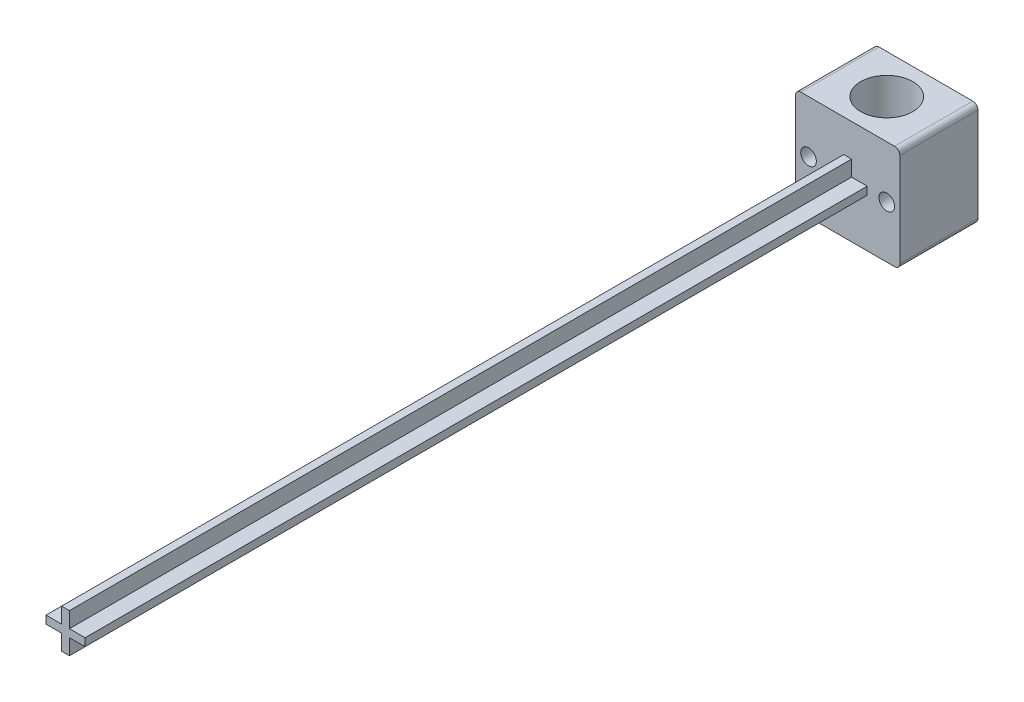
ISO-10303-21;
HEADER;
FILE_DESCRIPTION(('STEP AP214'),'2;1');
FILE_NAME('part.step','',(''),(''),'','','');
FILE_SCHEMA(('AUTOMOTIVE_DESIGN { 1 0 10303 214 1 1 1 1 }'));
ENDSEC;
DATA;
#1=APPLICATION_CONTEXT('core data for automotive mechanical design processes');
#2=APPLICATION_PROTOCOL_DEFINITION('international standard','automotive_design',2000,#1);
#3=PRODUCT_CONTEXT('',#1,'mechanical');
#4=PRODUCT('Part','Part','',(#3));
#5=PRODUCT_RELATED_PRODUCT_CATEGORY('part','',(#4));
#6=PRODUCT_DEFINITION_FORMATION('','',#4);
#7=PRODUCT_DEFINITION_CONTEXT('part definition',#1,'design');
#8=PRODUCT_DEFINITION('design','',#6,#7);
#9=PRODUCT_DEFINITION_SHAPE('','',#8);
#10=(LENGTH_UNIT() NAMED_UNIT(*) SI_UNIT(.MILLI.,.METRE.));
#11=(NAMED_UNIT(*) PLANE_ANGLE_UNIT() SI_UNIT($,.RADIAN.));
#12=(NAMED_UNIT(*) SI_UNIT($,.STERADIAN.) SOLID_ANGLE_UNIT());
#13=UNCERTAINTY_MEASURE_WITH_UNIT(LENGTH_MEASURE(1.E-05),#10,'distance_accuracy_value','');
#14=(GEOMETRIC_REPRESENTATION_CONTEXT(3) GLOBAL_UNCERTAINTY_ASSIGNED_CONTEXT((#13)) GLOBAL_UNIT_ASSIGNED_CONTEXT((#10,
#11,#12)) REPRESENTATION_CONTEXT('',''));
#15=CARTESIAN_POINT('',(0.,0.,0.));
#16=DIRECTION('',(0.,0.,1.));
#17=DIRECTION('',(1.,0.,0.));
#18=AXIS2_PLACEMENT_3D('',#15,#16,#17);
#19=CARTESIAN_POINT('',(0.,20.,0.));
#20=DIRECTION('',(0.,1.,0.));
#21=DIRECTION('',(0.,0.,1.));
#22=AXIS2_PLACEMENT_3D('',#19,#20,#21);
#23=PLANE('',#22);
#24=DIRECTION('',(1.,0.,0.));
#25=VECTOR('',#24,1.);
#26=CARTESIAN_POINT('',(-10.,20.,7.5));
#27=LINE('',#26,#25);
#28=CARTESIAN_POINT('',(-9.,20.,7.5));
#29=VERTEX_POINT('',#28);
#30=CARTESIAN_POINT('',(9.,20.,7.5));
#31=VERTEX_POINT('',#30);
#32=EDGE_CURVE('E329',#29,#31,#27,.T.);
#33=ORIENTED_EDGE('',*,*,#32,.T.);
#34=DIRECTION('',(0.,0.,-1.));
#35=VECTOR('',#34,1.);
#36=CARTESIAN_POINT('',(9.,20.,-7.5));
#37=LINE('',#36,#35);
#38=CARTESIAN_POINT('',(9.,20.,-7.5));
#39=VERTEX_POINT('',#38);
#40=EDGE_CURVE('E12',#31,#39,#37,.T.);
#41=ORIENTED_EDGE('',*,*,#40,.T.);
#42=DIRECTION('',(-1.,0.,0.));
#43=VECTOR('',#42,1.);
#44=CARTESIAN_POINT('',(-10.,20.,-7.5));
#45=LINE('',#44,#43);
#46=CARTESIAN_POINT('',(-9.,20.,-7.5));
#47=VERTEX_POINT('',#46);
#48=EDGE_CURVE('E325',#39,#47,#45,.T.);
#49=ORIENTED_EDGE('',*,*,#48,.T.);
#50=DIRECTION('',(0.,0.,1.));
#51=VECTOR('',#50,1.);
#52=CARTESIAN_POINT('',(-9.,20.,7.5));
#53=LINE('',#52,#51);
#54=EDGE_CURVE('E72',#47,#29,#53,.T.);
#55=ORIENTED_EDGE('',*,*,#54,.T.);
#56=EDGE_LOOP('',(#33,#41,#49,#55));
#57=FACE_BOUND('',#56,.T.);
#58=CARTESIAN_POINT('',(0.,20.,0.));
#59=DIRECTION('',(0.,1.,0.));
#60=DIRECTION('',(0.,0.,1.));
#61=AXIS2_PLACEMENT_3D('',#58,#59,#60);
#62=CIRCLE('',#61,5.);
#63=CARTESIAN_POINT('',(0.,20.,5.));
#64=VERTEX_POINT('',#63);
#65=EDGE_CURVE('E317',#64,#64,#62,.T.);
#66=ORIENTED_EDGE('',*,*,#65,.F.);
#67=EDGE_LOOP('',(#66));
#68=FACE_BOUND('',#67,.T.);
#69=ADVANCED_FACE('F63',(#57,#68),#23,.T.);
#70=CARTESIAN_POINT('',(0.,0.,0.));
#71=DIRECTION('',(0.,1.,0.));
#72=DIRECTION('',(0.,0.,1.));
#73=AXIS2_PLACEMENT_3D('',#70,#71,#72);
#74=PLANE('',#73);
#75=DIRECTION('',(1.,0.,0.));
#76=VECTOR('',#75,1.);
#77=CARTESIAN_POINT('',(-10.,0.,7.5));
#78=LINE('',#77,#76);
#79=CARTESIAN_POINT('',(-9.,0.,7.5));
#80=VERTEX_POINT('',#79);
#81=CARTESIAN_POINT('',(9.,0.,7.5));
#82=VERTEX_POINT('',#81);
#83=EDGE_CURVE('E330',#80,#82,#78,.T.);
#84=ORIENTED_EDGE('',*,*,#83,.F.);
#85=DIRECTION('',(0.,0.,1.));
#86=VECTOR('',#85,1.);
#87=CARTESIAN_POINT('',(-9.,0.,0.));
#88=LINE('',#87,#86);
#89=CARTESIAN_POINT('',(-9.,0.,-7.5));
#90=VERTEX_POINT('',#89);
#91=EDGE_CURVE('E377',#80,#90,#88,.F.);
#92=ORIENTED_EDGE('',*,*,#91,.T.);
#93=DIRECTION('',(-1.,0.,0.));
#94=VECTOR('',#93,1.);
#95=CARTESIAN_POINT('',(-10.,0.,-7.5));
#96=LINE('',#95,#94);
#97=CARTESIAN_POINT('',(9.,0.,-7.5));
#98=VERTEX_POINT('',#97);
#99=EDGE_CURVE('E321',#98,#90,#96,.T.);
#100=ORIENTED_EDGE('',*,*,#99,.F.);
#101=DIRECTION('',(0.,0.,-1.));
#102=VECTOR('',#101,1.);
#103=CARTESIAN_POINT('',(9.,0.,0.));
#104=LINE('',#103,#102);
#105=EDGE_CURVE('E374',#98,#82,#104,.F.);
#106=ORIENTED_EDGE('',*,*,#105,.T.);
#107=EDGE_LOOP('',(#84,#92,#100,#106));
#108=FACE_BOUND('',#107,.T.);
#109=CARTESIAN_POINT('',(0.,0.,0.));
#110=DIRECTION('',(0.,1.,0.));
#111=DIRECTION('',(0.,0.,1.));
#112=AXIS2_PLACEMENT_3D('',#109,#110,#111);
#113=CIRCLE('',#112,5.);
#114=CARTESIAN_POINT('',(0.,0.,5.));
#115=VERTEX_POINT('',#114);
#116=EDGE_CURVE('E316',#115,#115,#113,.T.);
#117=ORIENTED_EDGE('',*,*,#116,.T.);
#118=EDGE_LOOP('',(#117));
#119=FACE_BOUND('',#118,.T.);
#120=ADVANCED_FACE('F423',(#108,#119),#74,.F.);
#121=CARTESIAN_POINT('',(10.,20.,-7.5));
#122=DIRECTION('',(-1.,0.,0.));
#123=DIRECTION('',(0.,0.,1.));
#124=AXIS2_PLACEMENT_3D('',#121,#122,#123);
#125=PLANE('',#124);
#126=DIRECTION('',(0.,-1.,0.));
#127=VECTOR('',#126,1.);
#128=CARTESIAN_POINT('',(10.,20.,7.5));
#129=LINE('',#128,#127);
#130=CARTESIAN_POINT('',(10.,19.,7.5));
#131=VERTEX_POINT('',#130);
#132=CARTESIAN_POINT('',(10.,1.,7.5));
#133=VERTEX_POINT('',#132);
#134=EDGE_CURVE('E334',#131,#133,#129,.T.);
#135=ORIENTED_EDGE('',*,*,#134,.T.);
#136=DIRECTION('',(0.,0.,-1.));
#137=VECTOR('',#136,1.);
#138=CARTESIAN_POINT('',(10.,1.,-7.5));
#139=LINE('',#138,#137);
#140=CARTESIAN_POINT('',(10.,1.,-7.5));
#141=VERTEX_POINT('',#140);
#142=EDGE_CURVE('E393',#133,#141,#139,.T.);
#143=ORIENTED_EDGE('',*,*,#142,.T.);
#144=DIRECTION('',(0.,-1.,0.));
#145=VECTOR('',#144,1.);
#146=CARTESIAN_POINT('',(10.,20.,-7.5));
#147=LINE('',#146,#145);
#148=CARTESIAN_POINT('',(10.,19.,-7.5));
#149=VERTEX_POINT('',#148);
#150=EDGE_CURVE('E352',#149,#141,#147,.T.);
#151=ORIENTED_EDGE('',*,*,#150,.F.);
#152=DIRECTION('',(0.,0.,-1.));
#153=VECTOR('',#152,1.);
#154=CARTESIAN_POINT('',(10.,19.,7.5));
#155=LINE('',#154,#153);
#156=EDGE_CURVE('E390',#149,#131,#155,.F.);
#157=ORIENTED_EDGE('',*,*,#156,.T.);
#158=EDGE_LOOP('',(#135,#143,#151,#157));
#159=FACE_BOUND('',#158,.T.);
#160=ADVANCED_FACE('F430',(#159),#125,.F.);
#161=CARTESIAN_POINT('',(-10.,20.,-7.5));
#162=DIRECTION('',(0.,0.,1.));
#163=DIRECTION('',(1.,0.,0.));
#164=AXIS2_PLACEMENT_3D('',#161,#162,#163);
#165=PLANE('',#164);
#166=CARTESIAN_POINT('',(7.5,10.,-7.5));
#167=DIRECTION('',(0.,0.,1.));
#168=DIRECTION('',(1.,0.,0.));
#169=AXIS2_PLACEMENT_3D('',#166,#167,#168);
#170=CIRCLE('',#169,1.5);
#171=CARTESIAN_POINT('',(9.,10.,-7.5));
#172=VERTEX_POINT('',#171);
#173=EDGE_CURVE('E312',#172,#172,#170,.T.);
#174=ORIENTED_EDGE('',*,*,#173,.T.);
#175=EDGE_LOOP('',(#174));
#176=FACE_BOUND('',#175,.T.);
#177=CARTESIAN_POINT('',(-7.5,10.,-7.5));
#178=DIRECTION('',(0.,0.,1.));
#179=DIRECTION('',(1.,0.,0.));
#180=AXIS2_PLACEMENT_3D('',#177,#178,#179);
#181=CIRCLE('',#180,1.5);
#182=CARTESIAN_POINT('',(-6.,10.,-7.5));
#183=VERTEX_POINT('',#182);
#184=EDGE_CURVE('E305',#183,#183,#181,.T.);
#185=ORIENTED_EDGE('',*,*,#184,.T.);
#186=EDGE_LOOP('',(#185));
#187=FACE_BOUND('',#186,.T.);
#188=ORIENTED_EDGE('',*,*,#99,.T.);
#189=CARTESIAN_POINT('',(-9.,1.,-7.5));
#190=DIRECTION('',(0.,0.,1.));
#191=DIRECTION('',(1.,0.,0.));
#192=AXIS2_PLACEMENT_3D('',#189,#190,#191);
#193=CIRCLE('',#192,1.);
#194=CARTESIAN_POINT('',(-10.,1.,-7.5));
#195=VERTEX_POINT('',#194);
#196=EDGE_CURVE('E387',#90,#195,#193,.F.);
#197=ORIENTED_EDGE('',*,*,#196,.T.);
#198=DIRECTION('',(0.,-1.,0.));
#199=VECTOR('',#198,1.);
#200=CARTESIAN_POINT('',(-10.,20.,-7.5));
#201=LINE('',#200,#199);
#202=CARTESIAN_POINT('',(-10.,19.,-7.5));
#203=VERTEX_POINT('',#202);
#204=EDGE_CURVE('E348',#203,#195,#201,.T.);
#205=ORIENTED_EDGE('',*,*,#204,.F.);
#206=CARTESIAN_POINT('',(-9.,19.,-7.5));
#207=DIRECTION('',(0.,0.,1.));
#208=DIRECTION('',(1.,0.,0.));
#209=AXIS2_PLACEMENT_3D('',#206,#207,#208);
#210=CIRCLE('',#209,1.);
#211=EDGE_CURVE('E380',#203,#47,#210,.F.);
#212=ORIENTED_EDGE('',*,*,#211,.T.);
#213=ORIENTED_EDGE('',*,*,#48,.F.);
#214=CARTESIAN_POINT('',(9.,19.,-7.5));
#215=DIRECTION('',(0.,0.,1.));
#216=DIRECTION('',(1.,0.,0.));
#217=AXIS2_PLACEMENT_3D('',#214,#215,#216);
#218=CIRCLE('',#217,1.);
#219=EDGE_CURVE('E87',#39,#149,#218,.F.);
#220=ORIENTED_EDGE('',*,*,#219,.T.);
#221=ORIENTED_EDGE('',*,*,#150,.T.);
#222=CARTESIAN_POINT('',(9.,1.,-7.5));
#223=DIRECTION('',(0.,0.,1.));
#224=DIRECTION('',(1.,0.,0.));
#225=AXIS2_PLACEMENT_3D('',#222,#223,#224);
#226=CIRCLE('',#225,1.);
#227=EDGE_CURVE('E79',#141,#98,#226,.F.);
#228=ORIENTED_EDGE('',*,*,#227,.T.);
#229=EDGE_LOOP('',(#188,#197,#205,#212,#213,#220,#221,#228));
#230=FACE_BOUND('',#229,.T.);
#231=ADVANCED_FACE('F412',(#176,#187,#230),#165,.F.);
#232=CARTESIAN_POINT('',(-10.,20.,-7.5));
#233=DIRECTION('',(1.,0.,0.));
#234=DIRECTION('',(0.,0.,-1.));
#235=AXIS2_PLACEMENT_3D('',#232,#233,#234);
#236=PLANE('',#235);
#237=ORIENTED_EDGE('',*,*,#204,.T.);
#238=DIRECTION('',(0.,0.,1.));
#239=VECTOR('',#238,1.);
#240=CARTESIAN_POINT('',(-10.,1.,-7.5));
#241=LINE('',#240,#239);
#242=CARTESIAN_POINT('',(-10.,1.,7.5));
#243=VERTEX_POINT('',#242);
#244=EDGE_CURVE('E358',#195,#243,#241,.T.);
#245=ORIENTED_EDGE('',*,*,#244,.T.);
#246=DIRECTION('',(0.,-1.,0.));
#247=VECTOR('',#246,1.);
#248=CARTESIAN_POINT('',(-10.,20.,7.5));
#249=LINE('',#248,#247);
#250=CARTESIAN_POINT('',(-10.,19.,7.5));
#251=VERTEX_POINT('',#250);
#252=EDGE_CURVE('E344',#251,#243,#249,.T.);
#253=ORIENTED_EDGE('',*,*,#252,.F.);
#254=DIRECTION('',(0.,0.,1.));
#255=VECTOR('',#254,1.);
#256=CARTESIAN_POINT('',(-10.,19.,-7.5));
#257=LINE('',#256,#255);
#258=EDGE_CURVE('E355',#251,#203,#257,.F.);
#259=ORIENTED_EDGE('',*,*,#258,.T.);
#260=EDGE_LOOP('',(#237,#245,#253,#259));
#261=FACE_BOUND('',#260,.T.);
#262=ADVANCED_FACE('F416',(#261),#236,.F.);
#263=CARTESIAN_POINT('',(-10.,20.,7.5));
#264=DIRECTION('',(0.,0.,-1.));
#265=DIRECTION('',(-1.,0.,0.));
#266=AXIS2_PLACEMENT_3D('',#263,#264,#265);
#267=PLANE('',#266);
#268=DIRECTION('',(1.,0.,0.));
#269=VECTOR('',#268,1.);
#270=CARTESIAN_POINT('',(-0.749999999999999,13.75,7.5));
#271=LINE('',#270,#269);
#272=CARTESIAN_POINT('',(-0.749999999999999,13.75,7.5));
#273=VERTEX_POINT('',#272);
#274=CARTESIAN_POINT('',(0.750000000000001,13.75,7.5));
#275=VERTEX_POINT('',#274);
#276=EDGE_CURVE('E264',#273,#275,#271,.T.);
#277=ORIENTED_EDGE('',*,*,#276,.T.);
#278=DIRECTION('',(0.,-1.,0.));
#279=VECTOR('',#278,1.);
#280=CARTESIAN_POINT('',(0.750000000000001,13.75,7.5));
#281=LINE('',#280,#279);
#282=CARTESIAN_POINT('',(0.750000000000002,10.75,7.5));
#283=VERTEX_POINT('',#282);
#284=EDGE_CURVE('E269',#275,#283,#281,.T.);
#285=ORIENTED_EDGE('',*,*,#284,.T.);
#286=DIRECTION('',(1.,0.,0.));
#287=VECTOR('',#286,1.);
#288=CARTESIAN_POINT('',(-3.75,10.75,7.5));
#289=LINE('',#288,#287);
#290=CARTESIAN_POINT('',(3.75,10.75,7.5));
#291=VERTEX_POINT('',#290);
#292=EDGE_CURVE('E693',#283,#291,#289,.T.);
#293=ORIENTED_EDGE('',*,*,#292,.T.);
#294=DIRECTION('',(0.,-1.,0.));
#295=VECTOR('',#294,1.);
#296=CARTESIAN_POINT('',(3.75,10.75,7.5));
#297=LINE('',#296,#295);
#298=CARTESIAN_POINT('',(3.75,9.25,7.5));
#299=VERTEX_POINT('',#298);
#300=EDGE_CURVE('E689',#291,#299,#297,.T.);
#301=ORIENTED_EDGE('',*,*,#300,.T.);
#302=DIRECTION('',(1.,0.,0.));
#303=VECTOR('',#302,1.);
#304=CARTESIAN_POINT('',(-3.75,9.25,7.5));
#305=LINE('',#304,#303);
#306=CARTESIAN_POINT('',(0.750000000000001,9.25,7.5));
#307=VERTEX_POINT('',#306);
#308=EDGE_CURVE('E685',#307,#299,#305,.T.);
#309=ORIENTED_EDGE('',*,*,#308,.F.);
#310=CARTESIAN_POINT('',(0.750000000000002,6.25,7.5));
#311=VERTEX_POINT('',#310);
#312=EDGE_CURVE('E268',#307,#311,#281,.T.);
#313=ORIENTED_EDGE('',*,*,#312,.T.);
#314=DIRECTION('',(1.,0.,0.));
#315=VECTOR('',#314,1.);
#316=CARTESIAN_POINT('',(-0.749999999999998,6.25,7.5));
#317=LINE('',#316,#315);
#318=CARTESIAN_POINT('',(-0.749999999999998,6.25,7.5));
#319=VERTEX_POINT('',#318);
#320=EDGE_CURVE('E273',#319,#311,#317,.T.);
#321=ORIENTED_EDGE('',*,*,#320,.F.);
#322=DIRECTION('',(0.,-1.,0.));
#323=VECTOR('',#322,1.);
#324=CARTESIAN_POINT('',(-0.749999999999999,13.75,7.5));
#325=LINE('',#324,#323);
#326=CARTESIAN_POINT('',(-0.749999999999998,9.25,7.5));
#327=VERTEX_POINT('',#326);
#328=EDGE_CURVE('E276',#327,#319,#325,.T.);
#329=ORIENTED_EDGE('',*,*,#328,.F.);
#330=CARTESIAN_POINT('',(-3.75,9.25,7.5));
#331=VERTEX_POINT('',#330);
#332=EDGE_CURVE('E686',#331,#327,#305,.T.);
#333=ORIENTED_EDGE('',*,*,#332,.F.);
#334=DIRECTION('',(0.,-1.,0.));
#335=VECTOR('',#334,1.);
#336=CARTESIAN_POINT('',(-3.75,10.75,7.5));
#337=LINE('',#336,#335);
#338=CARTESIAN_POINT('',(-3.75,10.75,7.5));
#339=VERTEX_POINT('',#338);
#340=EDGE_CURVE('E230',#339,#331,#337,.T.);
#341=ORIENTED_EDGE('',*,*,#340,.F.);
#342=CARTESIAN_POINT('',(-0.749999999999999,10.75,7.5));
#343=VERTEX_POINT('',#342);
#344=EDGE_CURVE('E226',#339,#343,#289,.T.);
#345=ORIENTED_EDGE('',*,*,#344,.T.);
#346=EDGE_CURVE('E250',#273,#343,#325,.T.);
#347=ORIENTED_EDGE('',*,*,#346,.F.);
#348=EDGE_LOOP('',(#277,#285,#293,#301,#309,#313,#321,#329,#333,#341,#345,#347));
#349=FACE_BOUND('',#348,.T.);
#350=CARTESIAN_POINT('',(7.5,10.,7.5));
#351=DIRECTION('',(0.,0.,1.));
#352=DIRECTION('',(1.,0.,0.));
#353=AXIS2_PLACEMENT_3D('',#350,#351,#352);
#354=CIRCLE('',#353,1.5);
#355=CARTESIAN_POINT('',(9.,10.,7.5));
#356=VERTEX_POINT('',#355);
#357=EDGE_CURVE('E301',#356,#356,#354,.T.);
#358=ORIENTED_EDGE('',*,*,#357,.F.);
#359=EDGE_LOOP('',(#358));
#360=FACE_BOUND('',#359,.T.);
#361=CARTESIAN_POINT('',(-7.5,10.,7.5));
#362=DIRECTION('',(0.,0.,1.));
#363=DIRECTION('',(-1.,0.,0.));
#364=AXIS2_PLACEMENT_3D('',#361,#362,#363);
#365=CIRCLE('',#364,1.5);
#366=CARTESIAN_POINT('',(-9.,10.,7.5));
#367=VERTEX_POINT('',#366);
#368=EDGE_CURVE('E300',#367,#367,#365,.T.);
#369=ORIENTED_EDGE('',*,*,#368,.F.);
#370=EDGE_LOOP('',(#369));
#371=FACE_BOUND('',#370,.T.);
#372=ORIENTED_EDGE('',*,*,#252,.T.);
#373=CARTESIAN_POINT('',(-9.,1.,7.5));
#374=DIRECTION('',(0.,0.,-1.));
#375=DIRECTION('',(-1.,0.,0.));
#376=AXIS2_PLACEMENT_3D('',#373,#374,#375);
#377=CIRCLE('',#376,1.);
#378=EDGE_CURVE('E371',#243,#80,#377,.F.);
#379=ORIENTED_EDGE('',*,*,#378,.T.);
#380=ORIENTED_EDGE('',*,*,#83,.T.);
#381=CARTESIAN_POINT('',(9.,1.,7.5));
#382=DIRECTION('',(0.,0.,-1.));
#383=DIRECTION('',(-1.,0.,0.));
#384=AXIS2_PLACEMENT_3D('',#381,#382,#383);
#385=CIRCLE('',#384,1.);
#386=EDGE_CURVE('E368',#82,#133,#385,.F.);
#387=ORIENTED_EDGE('',*,*,#386,.T.);
#388=ORIENTED_EDGE('',*,*,#134,.F.);
#389=CARTESIAN_POINT('',(9.,19.,7.5));
#390=DIRECTION('',(0.,0.,-1.));
#391=DIRECTION('',(-1.,0.,0.));
#392=AXIS2_PLACEMENT_3D('',#389,#390,#391);
#393=CIRCLE('',#392,1.);
#394=EDGE_CURVE('E365',#131,#31,#393,.F.);
#395=ORIENTED_EDGE('',*,*,#394,.T.);
#396=ORIENTED_EDGE('',*,*,#32,.F.);
#397=CARTESIAN_POINT('',(-9.,19.,7.5));
#398=DIRECTION('',(0.,0.,-1.));
#399=DIRECTION('',(-1.,0.,0.));
#400=AXIS2_PLACEMENT_3D('',#397,#398,#399);
#401=CIRCLE('',#400,1.);
#402=EDGE_CURVE('E362',#29,#251,#401,.F.);
#403=ORIENTED_EDGE('',*,*,#402,.T.);
#404=EDGE_LOOP('',(#372,#379,#380,#387,#388,#395,#396,#403));
#405=FACE_BOUND('',#404,.T.);
#406=ADVANCED_FACE('F405',(#349,#360,#371,#405),#267,.F.);
#407=CARTESIAN_POINT('',(0.,20.,0.));
#408=DIRECTION('',(0.,-1.,0.));
#409=DIRECTION('',(0.,0.,-1.));
#410=AXIS2_PLACEMENT_3D('',#407,#408,#409);
#411=CYLINDRICAL_SURFACE('',#410,5.);
#412=ORIENTED_EDGE('',*,*,#65,.T.);
#413=EDGE_LOOP('',(#412));
#414=FACE_BOUND('',#413,.T.);
#415=ORIENTED_EDGE('',*,*,#116,.F.);
#416=EDGE_LOOP('',(#415));
#417=FACE_BOUND('',#416,.T.);
#418=ADVANCED_FACE('F446',(#414,#417),#411,.F.);
#419=CARTESIAN_POINT('',(-7.5,10.,-12.5));
#420=DIRECTION('',(0.,0.,1.));
#421=DIRECTION('',(1.,0.,0.));
#422=AXIS2_PLACEMENT_3D('',#419,#420,#421);
#423=CYLINDRICAL_SURFACE('',#422,1.5);
#424=ORIENTED_EDGE('',*,*,#368,.T.);
#425=EDGE_LOOP('',(#424));
#426=FACE_BOUND('',#425,.T.);
#427=ORIENTED_EDGE('',*,*,#184,.F.);
#428=EDGE_LOOP('',(#427));
#429=FACE_BOUND('',#428,.T.);
#430=ADVANCED_FACE('F468',(#426,#429),#423,.F.);
#431=CARTESIAN_POINT('',(7.5,10.,-12.5));
#432=DIRECTION('',(0.,0.,1.));
#433=DIRECTION('',(1.,0.,0.));
#434=AXIS2_PLACEMENT_3D('',#431,#432,#433);
#435=CYLINDRICAL_SURFACE('',#434,1.5);
#436=ORIENTED_EDGE('',*,*,#357,.T.);
#437=EDGE_LOOP('',(#436));
#438=FACE_BOUND('',#437,.T.);
#439=ORIENTED_EDGE('',*,*,#173,.F.);
#440=EDGE_LOOP('',(#439));
#441=FACE_BOUND('',#440,.T.);
#442=ADVANCED_FACE('F475',(#438,#441),#435,.F.);
#443=CARTESIAN_POINT('',(3.75,10.75,157.5));
#444=DIRECTION('',(1.,0.,0.));
#445=DIRECTION('',(0.,0.,-1.));
#446=AXIS2_PLACEMENT_3D('',#443,#444,#445);
#447=PLANE('',#446);
#448=ORIENTED_EDGE('',*,*,#300,.F.);
#449=DIRECTION('',(0.,0.,-1.));
#450=VECTOR('',#449,1.);
#451=CARTESIAN_POINT('',(3.75,10.75,157.5));
#452=LINE('',#451,#450);
#453=CARTESIAN_POINT('',(3.75,10.75,157.5));
#454=VERTEX_POINT('',#453);
#455=EDGE_CURVE('E241',#454,#291,#452,.T.);
#456=ORIENTED_EDGE('',*,*,#455,.F.);
#457=DIRECTION('',(0.,-1.,0.));
#458=VECTOR('',#457,1.);
#459=CARTESIAN_POINT('',(3.75,10.75,157.5));
#460=LINE('',#459,#458);
#461=CARTESIAN_POINT('',(3.75,9.25,157.5));
#462=VERTEX_POINT('',#461);
#463=EDGE_CURVE('E213',#454,#462,#460,.T.);
#464=ORIENTED_EDGE('',*,*,#463,.T.);
#465=DIRECTION('',(0.,0.,-1.));
#466=VECTOR('',#465,1.);
#467=CARTESIAN_POINT('',(3.75,9.25,157.5));
#468=LINE('',#467,#466);
#469=EDGE_CURVE('E234',#462,#299,#468,.T.);
#470=ORIENTED_EDGE('',*,*,#469,.T.);
#471=EDGE_LOOP('',(#448,#456,#464,#470));
#472=FACE_BOUND('',#471,.T.);
#473=ADVANCED_FACE('F482',(#472),#447,.T.);
#474=CARTESIAN_POINT('',(-3.75,10.75,157.5));
#475=DIRECTION('',(0.,1.,0.));
#476=DIRECTION('',(0.,0.,1.));
#477=AXIS2_PLACEMENT_3D('',#474,#475,#476);
#478=PLANE('',#477);
#479=DIRECTION('',(0.,0.,-1.));
#480=VECTOR('',#479,1.);
#481=CARTESIAN_POINT('',(0.750000000000001,10.75,157.5));
#482=LINE('',#481,#480);
#483=CARTESIAN_POINT('',(0.750000000000002,10.75,157.5));
#484=VERTEX_POINT('',#483);
#485=EDGE_CURVE('E233',#484,#283,#482,.T.);
#486=ORIENTED_EDGE('',*,*,#485,.F.);
#487=DIRECTION('',(1.,0.,0.));
#488=VECTOR('',#487,1.);
#489=CARTESIAN_POINT('',(-3.75,10.75,157.5));
#490=LINE('',#489,#488);
#491=EDGE_CURVE('E679',#484,#454,#490,.T.);
#492=ORIENTED_EDGE('',*,*,#491,.T.);
#493=ORIENTED_EDGE('',*,*,#455,.T.);
#494=ORIENTED_EDGE('',*,*,#292,.F.);
#495=EDGE_LOOP('',(#486,#492,#493,#494));
#496=FACE_BOUND('',#495,.T.);
#497=ADVANCED_FACE('F490',(#496),#478,.T.);
#498=CARTESIAN_POINT('',(-3.75,9.25,157.5));
#499=DIRECTION('',(0.,1.,0.));
#500=DIRECTION('',(0.,0.,1.));
#501=AXIS2_PLACEMENT_3D('',#498,#499,#500);
#502=PLANE('',#501);
#503=DIRECTION('',(1.,0.,0.));
#504=VECTOR('',#503,1.);
#505=CARTESIAN_POINT('',(-3.75,9.25,157.5));
#506=LINE('',#505,#504);
#507=CARTESIAN_POINT('',(0.750000000000001,9.25,157.5));
#508=VERTEX_POINT('',#507);
#509=EDGE_CURVE('E214',#508,#462,#506,.T.);
#510=ORIENTED_EDGE('',*,*,#509,.F.);
#511=DIRECTION('',(0.,0.,-1.));
#512=VECTOR('',#511,1.);
#513=CARTESIAN_POINT('',(0.750000000000002,9.25,157.5));
#514=LINE('',#513,#512);
#515=EDGE_CURVE('E293',#508,#307,#514,.T.);
#516=ORIENTED_EDGE('',*,*,#515,.T.);
#517=ORIENTED_EDGE('',*,*,#308,.T.);
#518=ORIENTED_EDGE('',*,*,#469,.F.);
#519=EDGE_LOOP('',(#510,#516,#517,#518));
#520=FACE_BOUND('',#519,.T.);
#521=ADVANCED_FACE('F498',(#520),#502,.F.);
#522=CARTESIAN_POINT('',(0.,0.,157.5));
#523=DIRECTION('',(0.,0.,1.));
#524=DIRECTION('',(1.,0.,0.));
#525=AXIS2_PLACEMENT_3D('',#522,#523,#524);
#526=PLANE('',#525);
#527=ORIENTED_EDGE('',*,*,#491,.F.);
#528=DIRECTION('',(0.,-1.,0.));
#529=VECTOR('',#528,1.);
#530=CARTESIAN_POINT('',(0.750000000000001,13.75,157.5));
#531=LINE('',#530,#529);
#532=CARTESIAN_POINT('',(0.750000000000001,13.75,157.5));
#533=VERTEX_POINT('',#532);
#534=EDGE_CURVE('E251',#533,#484,#531,.T.);
#535=ORIENTED_EDGE('',*,*,#534,.F.);
#536=DIRECTION('',(1.,0.,0.));
#537=VECTOR('',#536,1.);
#538=CARTESIAN_POINT('',(-0.749999999999999,13.75,157.5));
#539=LINE('',#538,#537);
#540=CARTESIAN_POINT('',(-0.749999999999999,13.75,157.5));
#541=VERTEX_POINT('',#540);
#542=EDGE_CURVE('E245',#541,#533,#539,.T.);
#543=ORIENTED_EDGE('',*,*,#542,.F.);
#544=DIRECTION('',(0.,-1.,0.));
#545=VECTOR('',#544,1.);
#546=CARTESIAN_POINT('',(-0.749999999999999,13.75,157.5));
#547=LINE('',#546,#545);
#548=CARTESIAN_POINT('',(-0.749999999999999,10.75,157.5));
#549=VERTEX_POINT('',#548);
#550=EDGE_CURVE('E260',#541,#549,#547,.T.);
#551=ORIENTED_EDGE('',*,*,#550,.T.);
#552=CARTESIAN_POINT('',(-3.75,10.75,157.5));
#553=VERTEX_POINT('',#552);
#554=EDGE_CURVE('E223',#553,#549,#490,.T.);
#555=ORIENTED_EDGE('',*,*,#554,.F.);
#556=DIRECTION('',(0.,-1.,0.));
#557=VECTOR('',#556,1.);
#558=CARTESIAN_POINT('',(-3.75,10.75,157.5));
#559=LINE('',#558,#557);
#560=CARTESIAN_POINT('',(-3.75,9.25,157.5));
#561=VERTEX_POINT('',#560);
#562=EDGE_CURVE('E218',#553,#561,#559,.T.);
#563=ORIENTED_EDGE('',*,*,#562,.T.);
#564=CARTESIAN_POINT('',(-0.749999999999998,9.25,157.5));
#565=VERTEX_POINT('',#564);
#566=EDGE_CURVE('E202',#561,#565,#506,.T.);
#567=ORIENTED_EDGE('',*,*,#566,.T.);
#568=CARTESIAN_POINT('',(-0.749999999999998,6.25,157.5));
#569=VERTEX_POINT('',#568);
#570=EDGE_CURVE('E259',#565,#569,#547,.T.);
#571=ORIENTED_EDGE('',*,*,#570,.T.);
#572=DIRECTION('',(1.,0.,0.));
#573=VECTOR('',#572,1.);
#574=CARTESIAN_POINT('',(-0.749999999999998,6.25,157.5));
#575=LINE('',#574,#573);
#576=CARTESIAN_POINT('',(0.750000000000002,6.25,157.5));
#577=VERTEX_POINT('',#576);
#578=EDGE_CURVE('E255',#569,#577,#575,.T.);
#579=ORIENTED_EDGE('',*,*,#578,.T.);
#580=EDGE_CURVE('E249',#508,#577,#531,.T.);
#581=ORIENTED_EDGE('',*,*,#580,.F.);
#582=ORIENTED_EDGE('',*,*,#509,.T.);
#583=ORIENTED_EDGE('',*,*,#463,.F.);
#584=EDGE_LOOP('',(#527,#535,#543,#551,#555,#563,#567,#571,#579,#581,#582,#583));
#585=FACE_BOUND('',#584,.T.);
#586=ADVANCED_FACE('F220',(#585),#526,.T.);
#587=ORIENTED_EDGE('',*,*,#554,.T.);
#588=DIRECTION('',(0.,0.,-1.));
#589=VECTOR('',#588,1.);
#590=CARTESIAN_POINT('',(-0.749999999999999,10.75,157.5));
#591=LINE('',#590,#589);
#592=EDGE_CURVE('E238',#549,#343,#591,.T.);
#593=ORIENTED_EDGE('',*,*,#592,.T.);
#594=ORIENTED_EDGE('',*,*,#344,.F.);
#595=DIRECTION('',(0.,0.,-1.));
#596=VECTOR('',#595,1.);
#597=CARTESIAN_POINT('',(-3.75,10.75,157.5));
#598=LINE('',#597,#596);
#599=EDGE_CURVE('E682',#553,#339,#598,.T.);
#600=ORIENTED_EDGE('',*,*,#599,.F.);
#601=EDGE_LOOP('',(#587,#593,#594,#600));
#602=FACE_BOUND('',#601,.T.);
#603=ADVANCED_FACE('F501',(#602),#478,.T.);
#604=CARTESIAN_POINT('',(-3.75,10.75,157.5));
#605=DIRECTION('',(1.,0.,0.));
#606=DIRECTION('',(0.,1.,0.));
#607=AXIS2_PLACEMENT_3D('',#604,#605,#606);
#608=PLANE('',#607);
#609=ORIENTED_EDGE('',*,*,#340,.T.);
#610=DIRECTION('',(0.,0.,-1.));
#611=VECTOR('',#610,1.);
#612=CARTESIAN_POINT('',(-3.75,9.25,157.5));
#613=LINE('',#612,#611);
#614=EDGE_CURVE('E207',#561,#331,#613,.T.);
#615=ORIENTED_EDGE('',*,*,#614,.F.);
#616=ORIENTED_EDGE('',*,*,#562,.F.);
#617=ORIENTED_EDGE('',*,*,#599,.T.);
#618=EDGE_LOOP('',(#609,#615,#616,#617));
#619=FACE_BOUND('',#618,.T.);
#620=ADVANCED_FACE('F228',(#619),#608,.F.);
#621=DIRECTION('',(0.,0.,-1.));
#622=VECTOR('',#621,1.);
#623=CARTESIAN_POINT('',(-0.749999999999999,9.25,157.5));
#624=LINE('',#623,#622);
#625=EDGE_CURVE('E209',#565,#327,#624,.T.);
#626=ORIENTED_EDGE('',*,*,#625,.F.);
#627=ORIENTED_EDGE('',*,*,#566,.F.);
#628=ORIENTED_EDGE('',*,*,#614,.T.);
#629=ORIENTED_EDGE('',*,*,#332,.T.);
#630=EDGE_LOOP('',(#626,#627,#628,#629));
#631=FACE_BOUND('',#630,.T.);
#632=ADVANCED_FACE('F204',(#631),#502,.F.);
#633=CARTESIAN_POINT('',(-0.749999999999999,13.75,157.5));
#634=DIRECTION('',(0.,1.,0.));
#635=DIRECTION('',(0.,0.,1.));
#636=AXIS2_PLACEMENT_3D('',#633,#634,#635);
#637=PLANE('',#636);
#638=ORIENTED_EDGE('',*,*,#276,.F.);
#639=DIRECTION('',(0.,0.,-1.));
#640=VECTOR('',#639,1.);
#641=CARTESIAN_POINT('',(-0.749999999999999,13.75,157.5));
#642=LINE('',#641,#640);
#643=EDGE_CURVE('E280',#541,#273,#642,.T.);
#644=ORIENTED_EDGE('',*,*,#643,.F.);
#645=ORIENTED_EDGE('',*,*,#542,.T.);
#646=DIRECTION('',(0.,0.,-1.));
#647=VECTOR('',#646,1.);
#648=CARTESIAN_POINT('',(0.750000000000001,13.75,157.5));
#649=LINE('',#648,#647);
#650=EDGE_CURVE('E263',#533,#275,#649,.T.);
#651=ORIENTED_EDGE('',*,*,#650,.T.);
#652=EDGE_LOOP('',(#638,#644,#645,#651));
#653=FACE_BOUND('',#652,.T.);
#654=ADVANCED_FACE('F532',(#653),#637,.T.);
#655=CARTESIAN_POINT('',(-0.749999999999999,13.75,157.5));
#656=DIRECTION('',(1.,0.,0.));
#657=DIRECTION('',(0.,1.,0.));
#658=AXIS2_PLACEMENT_3D('',#655,#656,#657);
#659=PLANE('',#658);
#660=ORIENTED_EDGE('',*,*,#592,.F.);
#661=ORIENTED_EDGE('',*,*,#550,.F.);
#662=ORIENTED_EDGE('',*,*,#643,.T.);
#663=ORIENTED_EDGE('',*,*,#346,.T.);
#664=EDGE_LOOP('',(#660,#661,#662,#663));
#665=FACE_BOUND('',#664,.T.);
#666=ADVANCED_FACE('F538',(#665),#659,.F.);
#667=CARTESIAN_POINT('',(0.750000000000001,13.75,157.5));
#668=DIRECTION('',(1.,0.,0.));
#669=DIRECTION('',(0.,1.,0.));
#670=AXIS2_PLACEMENT_3D('',#667,#668,#669);
#671=PLANE('',#670);
#672=ORIENTED_EDGE('',*,*,#534,.T.);
#673=ORIENTED_EDGE('',*,*,#485,.T.);
#674=ORIENTED_EDGE('',*,*,#284,.F.);
#675=ORIENTED_EDGE('',*,*,#650,.F.);
#676=EDGE_LOOP('',(#672,#673,#674,#675));
#677=FACE_BOUND('',#676,.T.);
#678=ADVANCED_FACE('F546',(#677),#671,.T.);
#679=ORIENTED_EDGE('',*,*,#570,.F.);
#680=ORIENTED_EDGE('',*,*,#625,.T.);
#681=ORIENTED_EDGE('',*,*,#328,.T.);
#682=DIRECTION('',(0.,0.,-1.));
#683=VECTOR('',#682,1.);
#684=CARTESIAN_POINT('',(-0.749999999999998,6.25,157.5));
#685=LINE('',#684,#683);
#686=EDGE_CURVE('E283',#569,#319,#685,.T.);
#687=ORIENTED_EDGE('',*,*,#686,.F.);
#688=EDGE_LOOP('',(#679,#680,#681,#687));
#689=FACE_BOUND('',#688,.T.);
#690=ADVANCED_FACE('F549',(#689),#659,.F.);
#691=CARTESIAN_POINT('',(-0.749999999999998,6.25,157.5));
#692=DIRECTION('',(0.,1.,0.));
#693=DIRECTION('',(0.,0.,1.));
#694=AXIS2_PLACEMENT_3D('',#691,#692,#693);
#695=PLANE('',#694);
#696=ORIENTED_EDGE('',*,*,#320,.T.);
#697=DIRECTION('',(0.,0.,-1.));
#698=VECTOR('',#697,1.);
#699=CARTESIAN_POINT('',(0.750000000000002,6.25,157.5));
#700=LINE('',#699,#698);
#701=EDGE_CURVE('E287',#577,#311,#700,.T.);
#702=ORIENTED_EDGE('',*,*,#701,.F.);
#703=ORIENTED_EDGE('',*,*,#578,.F.);
#704=ORIENTED_EDGE('',*,*,#686,.T.);
#705=EDGE_LOOP('',(#696,#702,#703,#704));
#706=FACE_BOUND('',#705,.T.);
#707=ADVANCED_FACE('F563',(#706),#695,.F.);
#708=ORIENTED_EDGE('',*,*,#515,.F.);
#709=ORIENTED_EDGE('',*,*,#580,.T.);
#710=ORIENTED_EDGE('',*,*,#701,.T.);
#711=ORIENTED_EDGE('',*,*,#312,.F.);
#712=EDGE_LOOP('',(#708,#709,#710,#711));
#713=FACE_BOUND('',#712,.T.);
#714=ADVANCED_FACE('F557',(#713),#671,.T.);
#715=CARTESIAN_POINT('',(-9.,1.,-7.5));
#716=DIRECTION('',(0.,0.,1.));
#717=DIRECTION('',(1.,0.,0.));
#718=AXIS2_PLACEMENT_3D('',#715,#716,#717);
#719=CYLINDRICAL_SURFACE('',#718,1.);
#720=ORIENTED_EDGE('',*,*,#196,.F.);
#721=ORIENTED_EDGE('',*,*,#91,.F.);
#722=ORIENTED_EDGE('',*,*,#378,.F.);
#723=ORIENTED_EDGE('',*,*,#244,.F.);
#724=EDGE_LOOP('',(#720,#721,#722,#723));
#725=FACE_BOUND('',#724,.T.);
#726=ADVANCED_FACE('F427',(#725),#719,.T.);
#727=CARTESIAN_POINT('',(9.,1.,-7.5));
#728=DIRECTION('',(0.,0.,-1.));
#729=DIRECTION('',(-1.,0.,0.));
#730=AXIS2_PLACEMENT_3D('',#727,#728,#729);
#731=CYLINDRICAL_SURFACE('',#730,1.);
#732=ORIENTED_EDGE('',*,*,#386,.F.);
#733=ORIENTED_EDGE('',*,*,#105,.F.);
#734=ORIENTED_EDGE('',*,*,#227,.F.);
#735=ORIENTED_EDGE('',*,*,#142,.F.);
#736=EDGE_LOOP('',(#732,#733,#734,#735));
#737=FACE_BOUND('',#736,.T.);
#738=ADVANCED_FACE('F428',(#737),#731,.T.);
#739=CARTESIAN_POINT('',(9.,19.,0.));
#740=DIRECTION('',(0.,0.,1.));
#741=DIRECTION('',(1.,0.,0.));
#742=AXIS2_PLACEMENT_3D('',#739,#740,#741);
#743=CYLINDRICAL_SURFACE('',#742,1.);
#744=ORIENTED_EDGE('',*,*,#394,.F.);
#745=ORIENTED_EDGE('',*,*,#156,.F.);
#746=ORIENTED_EDGE('',*,*,#219,.F.);
#747=ORIENTED_EDGE('',*,*,#40,.F.);
#748=EDGE_LOOP('',(#744,#745,#746,#747));
#749=FACE_BOUND('',#748,.T.);
#750=ADVANCED_FACE('F411',(#749),#743,.T.);
#751=CARTESIAN_POINT('',(-9.,19.,0.));
#752=DIRECTION('',(0.,0.,-1.));
#753=DIRECTION('',(-1.,0.,0.));
#754=AXIS2_PLACEMENT_3D('',#751,#752,#753);
#755=CYLINDRICAL_SURFACE('',#754,1.);
#756=ORIENTED_EDGE('',*,*,#211,.F.);
#757=ORIENTED_EDGE('',*,*,#258,.F.);
#758=ORIENTED_EDGE('',*,*,#402,.F.);
#759=ORIENTED_EDGE('',*,*,#54,.F.);
#760=EDGE_LOOP('',(#756,#757,#758,#759));
#761=FACE_BOUND('',#760,.T.);
#762=ADVANCED_FACE('F65',(#761),#755,.T.);
#763=CLOSED_SHELL('',(#69,#120,#160,#231,#262,#406,#418,#430,#442,#473,#497,#521,#586,#603,#620,
#632,#654,#666,#678,#690,#707,#714,#726,#738,#750,#762));
#764=MANIFOLD_SOLID_BREP('B2',#763);
#765=ADVANCED_BREP_SHAPE_REPRESENTATION('',(#18,#764),#14);
#766=SHAPE_DEFINITION_REPRESENTATION(#9,#765);
ENDSEC;
END-ISO-10303-21;
